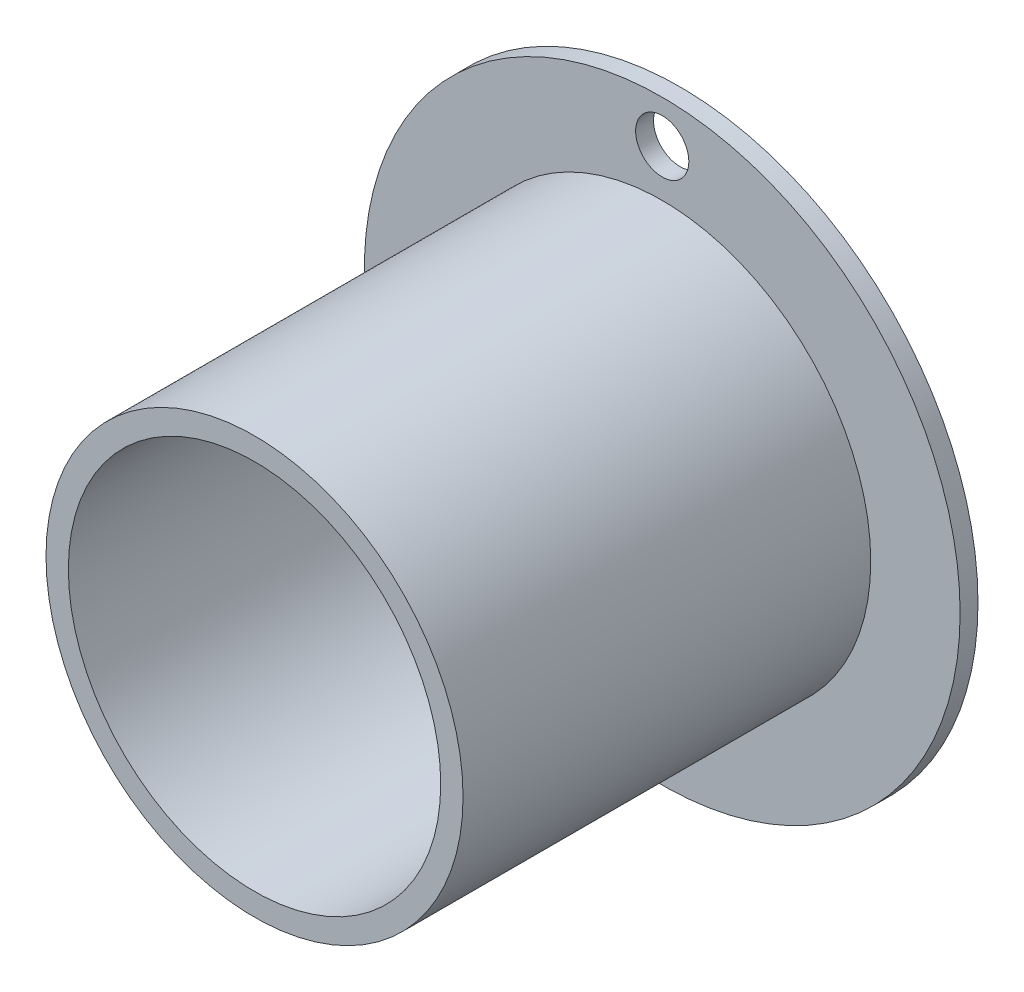
ISO-10303-21;
HEADER;
FILE_DESCRIPTION(('STEP AP214'),'2;1');
FILE_NAME('part.step','',(''),(''),'','','');
FILE_SCHEMA(('AUTOMOTIVE_DESIGN { 1 0 10303 214 1 1 1 1 }'));
ENDSEC;
DATA;
#1=APPLICATION_CONTEXT('core data for automotive mechanical design processes');
#2=APPLICATION_PROTOCOL_DEFINITION('international standard','automotive_design',2000,#1);
#3=PRODUCT_CONTEXT('',#1,'mechanical');
#4=PRODUCT('Part','Part','',(#3));
#5=PRODUCT_RELATED_PRODUCT_CATEGORY('part','',(#4));
#6=PRODUCT_DEFINITION_FORMATION('','',#4);
#7=PRODUCT_DEFINITION_CONTEXT('part definition',#1,'design');
#8=PRODUCT_DEFINITION('design','',#6,#7);
#9=PRODUCT_DEFINITION_SHAPE('','',#8);
#10=(LENGTH_UNIT() NAMED_UNIT(*) SI_UNIT(.MILLI.,.METRE.));
#11=(NAMED_UNIT(*) PLANE_ANGLE_UNIT() SI_UNIT($,.RADIAN.));
#12=(NAMED_UNIT(*) SI_UNIT($,.STERADIAN.) SOLID_ANGLE_UNIT());
#13=UNCERTAINTY_MEASURE_WITH_UNIT(LENGTH_MEASURE(1.E-05),#10,'distance_accuracy_value','');
#14=(GEOMETRIC_REPRESENTATION_CONTEXT(3) GLOBAL_UNCERTAINTY_ASSIGNED_CONTEXT((#13)) GLOBAL_UNIT_ASSIGNED_CONTEXT((#10,
#11,#12)) REPRESENTATION_CONTEXT('',''));
#15=CARTESIAN_POINT('',(0.,0.,0.));
#16=DIRECTION('',(0.,0.,1.));
#17=DIRECTION('',(1.,0.,0.));
#18=AXIS2_PLACEMENT_3D('',#15,#16,#17);
#19=CARTESIAN_POINT('',(0.,0.,25.4));
#20=DIRECTION('',(0.,0.,1.));
#21=DIRECTION('',(1.,0.,0.));
#22=AXIS2_PLACEMENT_3D('',#19,#20,#21);
#23=PLANE('',#22);
#24=CARTESIAN_POINT('',(0.,0.,25.4));
#25=DIRECTION('',(0.,0.,1.));
#26=DIRECTION('',(1.,0.,0.));
#27=AXIS2_PLACEMENT_3D('',#24,#25,#26);
#28=CIRCLE('',#27,11.1125);
#29=CARTESIAN_POINT('',(11.1125,0.,25.4));
#30=VERTEX_POINT('',#29);
#31=EDGE_CURVE('E44',#30,#30,#28,.T.);
#32=ORIENTED_EDGE('',*,*,#31,.F.);
#33=EDGE_LOOP('',(#32));
#34=FACE_BOUND('',#33,.T.);
#35=CARTESIAN_POINT('',(0.,0.,25.4));
#36=DIRECTION('',(0.,0.,1.));
#37=DIRECTION('',(1.,0.,0.));
#38=AXIS2_PLACEMENT_3D('',#35,#36,#37);
#39=CIRCLE('',#38,12.446);
#40=CARTESIAN_POINT('',(12.446,0.,25.4));
#41=VERTEX_POINT('',#40);
#42=EDGE_CURVE('E40',#41,#41,#39,.T.);
#43=ORIENTED_EDGE('',*,*,#42,.T.);
#44=EDGE_LOOP('',(#43));
#45=FACE_BOUND('',#44,.T.);
#46=ADVANCED_FACE('F36',(#34,#45),#23,.T.);
#47=CARTESIAN_POINT('',(0.,0.,25.4));
#48=DIRECTION('',(0.,0.,-1.));
#49=DIRECTION('',(-1.,0.,0.));
#50=AXIS2_PLACEMENT_3D('',#47,#48,#49);
#51=CYLINDRICAL_SURFACE('',#50,17.78);
#52=CARTESIAN_POINT('',(0.,0.,0.));
#53=DIRECTION('',(0.,0.,1.));
#54=DIRECTION('',(1.,0.,0.));
#55=AXIS2_PLACEMENT_3D('',#52,#53,#54);
#56=CIRCLE('',#55,17.78);
#57=CARTESIAN_POINT('',(17.78,0.,0.));
#58=VERTEX_POINT('',#57);
#59=EDGE_CURVE('E12',#58,#58,#56,.T.);
#60=ORIENTED_EDGE('',*,*,#59,.T.);
#61=EDGE_LOOP('',(#60));
#62=FACE_BOUND('',#61,.T.);
#63=CARTESIAN_POINT('',(0.,0.,1.0668));
#64=DIRECTION('',(0.,0.,1.));
#65=DIRECTION('',(1.,0.,0.));
#66=AXIS2_PLACEMENT_3D('',#63,#64,#65);
#67=CIRCLE('',#66,17.78);
#68=CARTESIAN_POINT('',(17.78,0.,1.0668));
#69=VERTEX_POINT('',#68);
#70=EDGE_CURVE('E52',#69,#69,#67,.T.);
#71=ORIENTED_EDGE('',*,*,#70,.F.);
#72=EDGE_LOOP('',(#71));
#73=FACE_BOUND('',#72,.T.);
#74=ADVANCED_FACE('F38',(#62,#73),#51,.T.);
#75=CARTESIAN_POINT('',(0.,0.,0.));
#76=DIRECTION('',(0.,0.,1.));
#77=DIRECTION('',(1.,0.,0.));
#78=AXIS2_PLACEMENT_3D('',#75,#76,#77);
#79=PLANE('',#78);
#80=CARTESIAN_POINT('',(0.,-15.24,0.));
#81=DIRECTION('',(0.,0.,1.));
#82=DIRECTION('',(1.,0.,0.));
#83=AXIS2_PLACEMENT_3D('',#80,#81,#82);
#84=CIRCLE('',#83,1.5875);
#85=CARTESIAN_POINT('',(1.5875,-15.24,0.));
#86=VERTEX_POINT('',#85);
#87=EDGE_CURVE('E69',#86,#86,#84,.T.);
#88=ORIENTED_EDGE('',*,*,#87,.T.);
#89=EDGE_LOOP('',(#88));
#90=FACE_BOUND('',#89,.T.);
#91=CARTESIAN_POINT('',(0.,15.24,0.));
#92=DIRECTION('',(0.,0.,1.));
#93=DIRECTION('',(1.,0.,0.));
#94=AXIS2_PLACEMENT_3D('',#91,#92,#93);
#95=CIRCLE('',#94,1.5875);
#96=CARTESIAN_POINT('',(1.5875,15.24,0.));
#97=VERTEX_POINT('',#96);
#98=EDGE_CURVE('E59',#97,#97,#95,.T.);
#99=ORIENTED_EDGE('',*,*,#98,.T.);
#100=EDGE_LOOP('',(#99));
#101=FACE_BOUND('',#100,.T.);
#102=ORIENTED_EDGE('',*,*,#59,.F.);
#103=EDGE_LOOP('',(#102));
#104=FACE_BOUND('',#103,.T.);
#105=CARTESIAN_POINT('',(0.,0.,0.));
#106=DIRECTION('',(0.,0.,1.));
#107=DIRECTION('',(1.,0.,0.));
#108=AXIS2_PLACEMENT_3D('',#105,#106,#107);
#109=CIRCLE('',#108,11.1125);
#110=CARTESIAN_POINT('',(11.1125,0.,0.));
#111=VERTEX_POINT('',#110);
#112=EDGE_CURVE('E49',#111,#111,#109,.T.);
#113=ORIENTED_EDGE('',*,*,#112,.T.);
#114=EDGE_LOOP('',(#113));
#115=FACE_BOUND('',#114,.T.);
#116=ADVANCED_FACE('F105',(#90,#101,#104,#115),#79,.F.);
#117=CARTESIAN_POINT('',(0.,0.,25.4));
#118=DIRECTION('',(0.,0.,-1.));
#119=DIRECTION('',(-1.,0.,0.));
#120=AXIS2_PLACEMENT_3D('',#117,#118,#119);
#121=CYLINDRICAL_SURFACE('',#120,11.1125);
#122=ORIENTED_EDGE('',*,*,#31,.T.);
#123=EDGE_LOOP('',(#122));
#124=FACE_BOUND('',#123,.T.);
#125=ORIENTED_EDGE('',*,*,#112,.F.);
#126=EDGE_LOOP('',(#125));
#127=FACE_BOUND('',#126,.T.);
#128=ADVANCED_FACE('F82',(#124,#127),#121,.F.);
#129=CARTESIAN_POINT('',(0.,0.,1.0668));
#130=DIRECTION('',(0.,0.,1.));
#131=DIRECTION('',(1.,0.,0.));
#132=AXIS2_PLACEMENT_3D('',#129,#130,#131);
#133=PLANE('',#132);
#134=CARTESIAN_POINT('',(0.,-15.24,1.0668));
#135=DIRECTION('',(0.,0.,1.));
#136=DIRECTION('',(1.,0.,0.));
#137=AXIS2_PLACEMENT_3D('',#134,#135,#136);
#138=CIRCLE('',#137,1.5875);
#139=CARTESIAN_POINT('',(1.5875,-15.24,1.0668));
#140=VERTEX_POINT('',#139);
#141=EDGE_CURVE('E72',#140,#140,#138,.T.);
#142=ORIENTED_EDGE('',*,*,#141,.F.);
#143=EDGE_LOOP('',(#142));
#144=FACE_BOUND('',#143,.T.);
#145=CARTESIAN_POINT('',(0.,15.24,1.0668));
#146=DIRECTION('',(0.,0.,1.));
#147=DIRECTION('',(1.,0.,0.));
#148=AXIS2_PLACEMENT_3D('',#145,#146,#147);
#149=CIRCLE('',#148,1.5875);
#150=CARTESIAN_POINT('',(1.5875,15.24,1.0668));
#151=VERTEX_POINT('',#150);
#152=EDGE_CURVE('E64',#151,#151,#149,.T.);
#153=ORIENTED_EDGE('',*,*,#152,.F.);
#154=EDGE_LOOP('',(#153));
#155=FACE_BOUND('',#154,.T.);
#156=CARTESIAN_POINT('',(0.,0.,1.0668));
#157=DIRECTION('',(0.,0.,1.));
#158=DIRECTION('',(1.,0.,0.));
#159=AXIS2_PLACEMENT_3D('',#156,#157,#158);
#160=CIRCLE('',#159,12.446);
#161=CARTESIAN_POINT('',(12.446,0.,1.0668));
#162=VERTEX_POINT('',#161);
#163=EDGE_CURVE('E54',#162,#162,#160,.F.);
#164=ORIENTED_EDGE('',*,*,#163,.T.);
#165=EDGE_LOOP('',(#164));
#166=FACE_BOUND('',#165,.T.);
#167=ORIENTED_EDGE('',*,*,#70,.T.);
#168=EDGE_LOOP('',(#167));
#169=FACE_BOUND('',#168,.T.);
#170=ADVANCED_FACE('F78',(#144,#155,#166,#169),#133,.T.);
#171=CARTESIAN_POINT('',(0.,0.,-50.7923286207671));
#172=DIRECTION('',(0.,0.,1.));
#173=DIRECTION('',(1.,0.,0.));
#174=AXIS2_PLACEMENT_3D('',#171,#172,#173);
#175=CYLINDRICAL_SURFACE('',#174,12.446);
#176=ORIENTED_EDGE('',*,*,#42,.F.);
#177=EDGE_LOOP('',(#176));
#178=FACE_BOUND('',#177,.T.);
#179=ORIENTED_EDGE('',*,*,#163,.F.);
#180=EDGE_LOOP('',(#179));
#181=FACE_BOUND('',#180,.T.);
#182=ADVANCED_FACE('F81',(#178,#181),#175,.T.);
#183=CARTESIAN_POINT('',(0.,15.24,1.0668));
#184=DIRECTION('',(0.,0.,1.));
#185=DIRECTION('',(1.,0.,0.));
#186=AXIS2_PLACEMENT_3D('',#183,#184,#185);
#187=CYLINDRICAL_SURFACE('',#186,1.5875);
#188=ORIENTED_EDGE('',*,*,#98,.F.);
#189=EDGE_LOOP('',(#188));
#190=FACE_BOUND('',#189,.T.);
#191=ORIENTED_EDGE('',*,*,#152,.T.);
#192=EDGE_LOOP('',(#191));
#193=FACE_BOUND('',#192,.T.);
#194=ADVANCED_FACE('F86',(#190,#193),#187,.F.);
#195=CARTESIAN_POINT('',(0.,-15.24,1.0668));
#196=DIRECTION('',(0.,0.,1.));
#197=DIRECTION('',(1.,0.,0.));
#198=AXIS2_PLACEMENT_3D('',#195,#196,#197);
#199=CYLINDRICAL_SURFACE('',#198,1.5875);
#200=ORIENTED_EDGE('',*,*,#87,.F.);
#201=EDGE_LOOP('',(#200));
#202=FACE_BOUND('',#201,.T.);
#203=ORIENTED_EDGE('',*,*,#141,.T.);
#204=EDGE_LOOP('',(#203));
#205=FACE_BOUND('',#204,.T.);
#206=ADVANCED_FACE('F76',(#202,#205),#199,.F.);
#207=CLOSED_SHELL('',(#46,#74,#116,#128,#170,#182,#194,#206));
#208=MANIFOLD_SOLID_BREP('B2',#207);
#209=ADVANCED_BREP_SHAPE_REPRESENTATION('',(#18,#208),#14);
#210=SHAPE_DEFINITION_REPRESENTATION(#9,#209);
ENDSEC;
END-ISO-10303-21;
